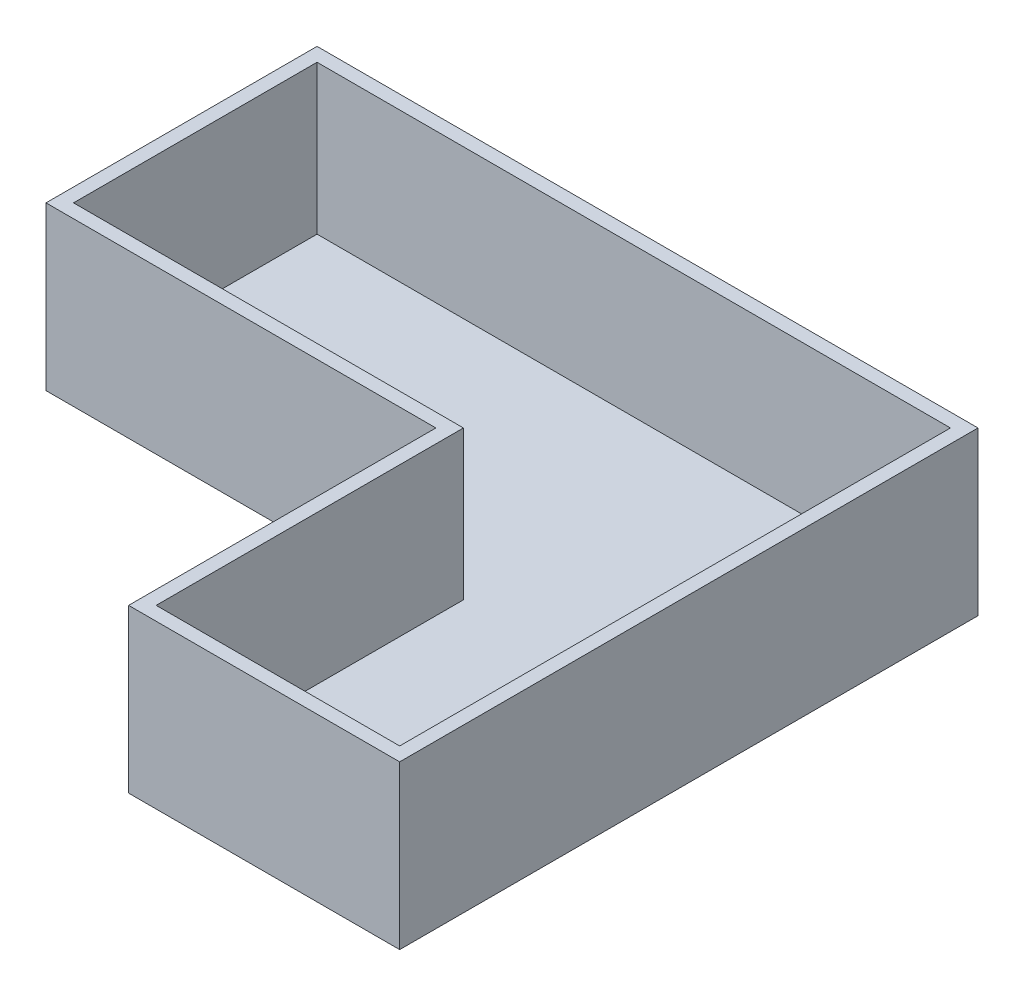
ISO-10303-21;
HEADER;
FILE_DESCRIPTION(('STEP AP214'),'2;1');
FILE_NAME('part.step','',(''),(''),'','','');
FILE_SCHEMA(('AUTOMOTIVE_DESIGN { 1 0 10303 214 1 1 1 1 }'));
ENDSEC;
DATA;
#1=APPLICATION_CONTEXT('core data for automotive mechanical design processes');
#2=APPLICATION_PROTOCOL_DEFINITION('international standard','automotive_design',2000,#1);
#3=PRODUCT_CONTEXT('',#1,'mechanical');
#4=PRODUCT('Part','Part','',(#3));
#5=PRODUCT_RELATED_PRODUCT_CATEGORY('part','',(#4));
#6=PRODUCT_DEFINITION_FORMATION('','',#4);
#7=PRODUCT_DEFINITION_CONTEXT('part definition',#1,'design');
#8=PRODUCT_DEFINITION('design','',#6,#7);
#9=PRODUCT_DEFINITION_SHAPE('','',#8);
#10=(LENGTH_UNIT() NAMED_UNIT(*) SI_UNIT(.MILLI.,.METRE.));
#11=(NAMED_UNIT(*) PLANE_ANGLE_UNIT() SI_UNIT($,.RADIAN.));
#12=(NAMED_UNIT(*) SI_UNIT($,.STERADIAN.) SOLID_ANGLE_UNIT());
#13=UNCERTAINTY_MEASURE_WITH_UNIT(LENGTH_MEASURE(1.E-05),#10,'distance_accuracy_value','');
#14=(GEOMETRIC_REPRESENTATION_CONTEXT(3) GLOBAL_UNCERTAINTY_ASSIGNED_CONTEXT((#13)) GLOBAL_UNIT_ASSIGNED_CONTEXT((#10,
#11,#12)) REPRESENTATION_CONTEXT('',''));
#15=CARTESIAN_POINT('',(0.,0.,0.));
#16=DIRECTION('',(0.,0.,1.));
#17=DIRECTION('',(1.,0.,0.));
#18=AXIS2_PLACEMENT_3D('',#15,#16,#17);
#19=CARTESIAN_POINT('',(859.6,300.,0.));
#20=DIRECTION('',(-1.,0.,0.));
#21=DIRECTION('',(0.,0.,1.));
#22=AXIS2_PLACEMENT_3D('',#19,#20,#21);
#23=PLANE('',#22);
#24=DIRECTION('',(0.,0.,-1.));
#25=VECTOR('',#24,1.);
#26=CARTESIAN_POINT('',(859.6,0.,0.));
#27=LINE('',#26,#25);
#28=CARTESIAN_POINT('',(859.6,0.,0.));
#29=VERTEX_POINT('',#28);
#30=CARTESIAN_POINT('',(859.6,0.,-1066.8));
#31=VERTEX_POINT('',#30);
#32=EDGE_CURVE('E129',#29,#31,#27,.T.);
#33=ORIENTED_EDGE('',*,*,#32,.T.);
#34=DIRECTION('',(0.,-1.,0.));
#35=VECTOR('',#34,1.);
#36=CARTESIAN_POINT('',(859.6,300.,-1066.8));
#37=LINE('',#36,#35);
#38=CARTESIAN_POINT('',(859.6,300.,-1066.8));
#39=VERTEX_POINT('',#38);
#40=EDGE_CURVE('E11',#39,#31,#37,.T.);
#41=ORIENTED_EDGE('',*,*,#40,.F.);
#42=DIRECTION('',(0.,0.,-1.));
#43=VECTOR('',#42,1.);
#44=CARTESIAN_POINT('',(859.6,300.,0.));
#45=LINE('',#44,#43);
#46=CARTESIAN_POINT('',(859.6,300.,0.));
#47=VERTEX_POINT('',#46);
#48=EDGE_CURVE('E141',#47,#39,#45,.T.);
#49=ORIENTED_EDGE('',*,*,#48,.F.);
#50=DIRECTION('',(0.,-1.,0.));
#51=VECTOR('',#50,1.);
#52=CARTESIAN_POINT('',(859.6,300.,0.));
#53=LINE('',#52,#51);
#54=EDGE_CURVE('E125',#47,#29,#53,.T.);
#55=ORIENTED_EDGE('',*,*,#54,.T.);
#56=EDGE_LOOP('',(#33,#41,#49,#55));
#57=FACE_BOUND('',#56,.T.);
#58=ADVANCED_FACE('F33',(#57),#23,.F.);
#59=CARTESIAN_POINT('',(359.6,300.,-1066.8));
#60=DIRECTION('',(0.,0.,1.));
#61=DIRECTION('',(1.,0.,0.));
#62=AXIS2_PLACEMENT_3D('',#59,#60,#61);
#63=PLANE('',#62);
#64=DIRECTION('',(-1.,0.,0.));
#65=VECTOR('',#64,1.);
#66=CARTESIAN_POINT('',(359.6,0.,-1066.8));
#67=LINE('',#66,#65);
#68=CARTESIAN_POINT('',(-359.6,0.,-1066.8));
#69=VERTEX_POINT('',#68);
#70=EDGE_CURVE('E132',#31,#69,#67,.T.);
#71=ORIENTED_EDGE('',*,*,#70,.T.);
#72=DIRECTION('',(0.,-1.,0.));
#73=VECTOR('',#72,1.);
#74=CARTESIAN_POINT('',(-359.6,300.,-1066.8));
#75=LINE('',#74,#73);
#76=CARTESIAN_POINT('',(-359.6,300.,-1066.8));
#77=VERTEX_POINT('',#76);
#78=EDGE_CURVE('E40',#77,#69,#75,.T.);
#79=ORIENTED_EDGE('',*,*,#78,.F.);
#80=DIRECTION('',(-1.,0.,0.));
#81=VECTOR('',#80,1.);
#82=CARTESIAN_POINT('',(359.6,300.,-1066.8));
#83=LINE('',#82,#81);
#84=EDGE_CURVE('E91',#39,#77,#83,.T.);
#85=ORIENTED_EDGE('',*,*,#84,.F.);
#86=ORIENTED_EDGE('',*,*,#40,.T.);
#87=EDGE_LOOP('',(#71,#79,#85,#86));
#88=FACE_BOUND('',#87,.T.);
#89=ADVANCED_FACE('F263',(#88),#63,.F.);
#90=CARTESIAN_POINT('',(-359.6,300.,-1066.8));
#91=DIRECTION('',(1.,0.,0.));
#92=DIRECTION('',(0.,0.,-1.));
#93=AXIS2_PLACEMENT_3D('',#90,#91,#92);
#94=PLANE('',#93);
#95=DIRECTION('',(0.,0.,1.));
#96=VECTOR('',#95,1.);
#97=CARTESIAN_POINT('',(-359.6,0.,-1066.8));
#98=LINE('',#97,#96);
#99=CARTESIAN_POINT('',(-359.6,0.,-566.8));
#100=VERTEX_POINT('',#99);
#101=EDGE_CURVE('E135',#69,#100,#98,.T.);
#102=ORIENTED_EDGE('',*,*,#101,.T.);
#103=DIRECTION('',(0.,-1.,0.));
#104=VECTOR('',#103,1.);
#105=CARTESIAN_POINT('',(-359.6,300.,-566.8));
#106=LINE('',#105,#104);
#107=CARTESIAN_POINT('',(-359.6,300.,-566.8));
#108=VERTEX_POINT('',#107);
#109=EDGE_CURVE('E120',#108,#100,#106,.T.);
#110=ORIENTED_EDGE('',*,*,#109,.F.);
#111=DIRECTION('',(0.,0.,1.));
#112=VECTOR('',#111,1.);
#113=CARTESIAN_POINT('',(-359.6,300.,-1066.8));
#114=LINE('',#113,#112);
#115=EDGE_CURVE('E108',#77,#108,#114,.T.);
#116=ORIENTED_EDGE('',*,*,#115,.F.);
#117=ORIENTED_EDGE('',*,*,#78,.T.);
#118=EDGE_LOOP('',(#102,#110,#116,#117));
#119=FACE_BOUND('',#118,.T.);
#120=ADVANCED_FACE('F147',(#119),#94,.F.);
#121=CARTESIAN_POINT('',(-359.6,300.,-566.8));
#122=DIRECTION('',(0.,0.,-1.));
#123=DIRECTION('',(-1.,0.,0.));
#124=AXIS2_PLACEMENT_3D('',#121,#122,#123);
#125=PLANE('',#124);
#126=DIRECTION('',(1.,0.,0.));
#127=VECTOR('',#126,1.);
#128=CARTESIAN_POINT('',(-359.6,0.,-566.8));
#129=LINE('',#128,#127);
#130=CARTESIAN_POINT('',(359.6,0.,-566.8));
#131=VERTEX_POINT('',#130);
#132=EDGE_CURVE('E117',#100,#131,#129,.T.);
#133=ORIENTED_EDGE('',*,*,#132,.T.);
#134=DIRECTION('',(0.,-1.,0.));
#135=VECTOR('',#134,1.);
#136=CARTESIAN_POINT('',(359.6,300.,-566.8));
#137=LINE('',#136,#135);
#138=CARTESIAN_POINT('',(359.6,300.,-566.8));
#139=VERTEX_POINT('',#138);
#140=EDGE_CURVE('E114',#139,#131,#137,.T.);
#141=ORIENTED_EDGE('',*,*,#140,.F.);
#142=DIRECTION('',(1.,0.,0.));
#143=VECTOR('',#142,1.);
#144=CARTESIAN_POINT('',(-359.6,300.,-566.8));
#145=LINE('',#144,#143);
#146=EDGE_CURVE('E101',#108,#139,#145,.T.);
#147=ORIENTED_EDGE('',*,*,#146,.F.);
#148=ORIENTED_EDGE('',*,*,#109,.T.);
#149=EDGE_LOOP('',(#133,#141,#147,#148));
#150=FACE_BOUND('',#149,.T.);
#151=ADVANCED_FACE('F115',(#150),#125,.F.);
#152=CARTESIAN_POINT('',(359.6,300.,-1.32114896692016E-13));
#153=DIRECTION('',(1.,0.,0.));
#154=DIRECTION('',(0.,0.,-1.));
#155=AXIS2_PLACEMENT_3D('',#152,#153,#154);
#156=PLANE('',#155);
#157=DIRECTION('',(0.,0.,1.));
#158=VECTOR('',#157,1.);
#159=CARTESIAN_POINT('',(359.6,0.,-1.32114896692016E-13));
#160=LINE('',#159,#158);
#161=CARTESIAN_POINT('',(359.6,0.,-1.32114896692016E-13));
#162=VERTEX_POINT('',#161);
#163=EDGE_CURVE('E138',#131,#162,#160,.T.);
#164=ORIENTED_EDGE('',*,*,#163,.T.);
#165=DIRECTION('',(0.,-1.,0.));
#166=VECTOR('',#165,1.);
#167=CARTESIAN_POINT('',(359.6,300.,-1.32114896692016E-13));
#168=LINE('',#167,#166);
#169=CARTESIAN_POINT('',(359.6,300.,-1.32114896692016E-13));
#170=VERTEX_POINT('',#169);
#171=EDGE_CURVE('E121',#170,#162,#168,.T.);
#172=ORIENTED_EDGE('',*,*,#171,.F.);
#173=DIRECTION('',(0.,0.,1.));
#174=VECTOR('',#173,1.);
#175=CARTESIAN_POINT('',(359.6,300.,-1.32114896692016E-13));
#176=LINE('',#175,#174);
#177=EDGE_CURVE('E105',#139,#170,#176,.T.);
#178=ORIENTED_EDGE('',*,*,#177,.F.);
#179=ORIENTED_EDGE('',*,*,#140,.T.);
#180=EDGE_LOOP('',(#164,#172,#178,#179));
#181=FACE_BOUND('',#180,.T.);
#182=ADVANCED_FACE('F123',(#181),#156,.F.);
#183=CARTESIAN_POINT('',(359.6,300.,-1.32114896692016E-13));
#184=DIRECTION('',(0.,0.,-1.));
#185=DIRECTION('',(-1.,0.,0.));
#186=AXIS2_PLACEMENT_3D('',#183,#184,#185);
#187=PLANE('',#186);
#188=DIRECTION('',(1.,0.,0.));
#189=VECTOR('',#188,1.);
#190=CARTESIAN_POINT('',(359.6,0.,-1.32114896692016E-13));
#191=LINE('',#190,#189);
#192=EDGE_CURVE('E83',#162,#29,#191,.T.);
#193=ORIENTED_EDGE('',*,*,#192,.T.);
#194=ORIENTED_EDGE('',*,*,#54,.F.);
#195=DIRECTION('',(1.,0.,0.));
#196=VECTOR('',#195,1.);
#197=CARTESIAN_POINT('',(359.6,300.,-1.32114896692016E-13));
#198=LINE('',#197,#196);
#199=EDGE_CURVE('E56',#170,#47,#198,.T.);
#200=ORIENTED_EDGE('',*,*,#199,.F.);
#201=ORIENTED_EDGE('',*,*,#171,.T.);
#202=EDGE_LOOP('',(#193,#194,#200,#201));
#203=FACE_BOUND('',#202,.T.);
#204=ADVANCED_FACE('F151',(#203),#187,.F.);
#205=CARTESIAN_POINT('',(0.,300.,0.));
#206=DIRECTION('',(0.,-1.,0.));
#207=DIRECTION('',(0.,0.,-1.));
#208=AXIS2_PLACEMENT_3D('',#205,#206,#207);
#209=PLANE('',#208);
#210=DIRECTION('',(0.,0.,-1.));
#211=VECTOR('',#210,1.);
#212=CARTESIAN_POINT('',(834.2,300.,-25.4));
#213=LINE('',#212,#211);
#214=CARTESIAN_POINT('',(834.2,300.,-25.4));
#215=VERTEX_POINT('',#214);
#216=CARTESIAN_POINT('',(834.2,300.,-1041.4));
#217=VERTEX_POINT('',#216);
#218=EDGE_CURVE('E187',#215,#217,#213,.T.);
#219=ORIENTED_EDGE('',*,*,#218,.F.);
#220=DIRECTION('',(1.,0.,0.));
#221=VECTOR('',#220,1.);
#222=CARTESIAN_POINT('',(385.,300.,-25.4000000000001));
#223=LINE('',#222,#221);
#224=CARTESIAN_POINT('',(385.,300.,-25.4000000000001));
#225=VERTEX_POINT('',#224);
#226=EDGE_CURVE('E47',#225,#215,#223,.T.);
#227=ORIENTED_EDGE('',*,*,#226,.F.);
#228=DIRECTION('',(0.,0.,1.));
#229=VECTOR('',#228,1.);
#230=CARTESIAN_POINT('',(385.,300.,-592.2));
#231=LINE('',#230,#229);
#232=CARTESIAN_POINT('',(385.,300.,-592.2));
#233=VERTEX_POINT('',#232);
#234=EDGE_CURVE('E174',#233,#225,#231,.T.);
#235=ORIENTED_EDGE('',*,*,#234,.F.);
#236=DIRECTION('',(1.,0.,0.));
#237=VECTOR('',#236,1.);
#238=CARTESIAN_POINT('',(-334.2,300.,-592.2));
#239=LINE('',#238,#237);
#240=CARTESIAN_POINT('',(-334.2,300.,-592.2));
#241=VERTEX_POINT('',#240);
#242=EDGE_CURVE('E178',#241,#233,#239,.T.);
#243=ORIENTED_EDGE('',*,*,#242,.F.);
#244=DIRECTION('',(0.,0.,1.));
#245=VECTOR('',#244,1.);
#246=CARTESIAN_POINT('',(-334.2,300.,-1041.4));
#247=LINE('',#246,#245);
#248=CARTESIAN_POINT('',(-334.2,300.,-1041.4));
#249=VERTEX_POINT('',#248);
#250=EDGE_CURVE('E181',#249,#241,#247,.T.);
#251=ORIENTED_EDGE('',*,*,#250,.F.);
#252=DIRECTION('',(-1.,0.,0.));
#253=VECTOR('',#252,1.);
#254=CARTESIAN_POINT('',(834.2,300.,-1041.4));
#255=LINE('',#254,#253);
#256=EDGE_CURVE('E184',#217,#249,#255,.T.);
#257=ORIENTED_EDGE('',*,*,#256,.F.);
#258=EDGE_LOOP('',(#219,#227,#235,#243,#251,#257));
#259=FACE_BOUND('',#258,.T.);
#260=ORIENTED_EDGE('',*,*,#48,.T.);
#261=ORIENTED_EDGE('',*,*,#84,.T.);
#262=ORIENTED_EDGE('',*,*,#115,.T.);
#263=ORIENTED_EDGE('',*,*,#146,.T.);
#264=ORIENTED_EDGE('',*,*,#177,.T.);
#265=ORIENTED_EDGE('',*,*,#199,.T.);
#266=EDGE_LOOP('',(#260,#261,#262,#263,#264,#265));
#267=FACE_BOUND('',#266,.T.);
#268=ADVANCED_FACE('F103',(#259,#267),#209,.F.);
#269=CARTESIAN_POINT('',(0.,0.,0.));
#270=DIRECTION('',(0.,-1.,0.));
#271=DIRECTION('',(0.,0.,-1.));
#272=AXIS2_PLACEMENT_3D('',#269,#270,#271);
#273=PLANE('',#272);
#274=ORIENTED_EDGE('',*,*,#32,.F.);
#275=ORIENTED_EDGE('',*,*,#192,.F.);
#276=ORIENTED_EDGE('',*,*,#163,.F.);
#277=ORIENTED_EDGE('',*,*,#132,.F.);
#278=ORIENTED_EDGE('',*,*,#101,.F.);
#279=ORIENTED_EDGE('',*,*,#70,.F.);
#280=EDGE_LOOP('',(#274,#275,#276,#277,#278,#279));
#281=FACE_BOUND('',#280,.T.);
#282=ADVANCED_FACE('F150',(#281),#273,.T.);
#283=CARTESIAN_POINT('',(385.,25.4,-25.4000000000001));
#284=DIRECTION('',(0.,0.,1.));
#285=DIRECTION('',(1.,0.,0.));
#286=AXIS2_PLACEMENT_3D('',#283,#284,#285);
#287=PLANE('',#286);
#288=ORIENTED_EDGE('',*,*,#226,.T.);
#289=DIRECTION('',(0.,1.,0.));
#290=VECTOR('',#289,1.);
#291=CARTESIAN_POINT('',(834.2,25.4,-25.4));
#292=LINE('',#291,#290);
#293=CARTESIAN_POINT('',(834.2,25.4,-25.4));
#294=VERTEX_POINT('',#293);
#295=EDGE_CURVE('E158',#294,#215,#292,.T.);
#296=ORIENTED_EDGE('',*,*,#295,.F.);
#297=DIRECTION('',(1.,0.,0.));
#298=VECTOR('',#297,1.);
#299=CARTESIAN_POINT('',(385.,25.4,-25.4000000000001));
#300=LINE('',#299,#298);
#301=CARTESIAN_POINT('',(385.,25.4,-25.4000000000001));
#302=VERTEX_POINT('',#301);
#303=EDGE_CURVE('E177',#302,#294,#300,.T.);
#304=ORIENTED_EDGE('',*,*,#303,.F.);
#305=DIRECTION('',(0.,1.,0.));
#306=VECTOR('',#305,1.);
#307=CARTESIAN_POINT('',(385.,25.4,-25.4000000000001));
#308=LINE('',#307,#306);
#309=EDGE_CURVE('E133',#302,#225,#308,.T.);
#310=ORIENTED_EDGE('',*,*,#309,.T.);
#311=EDGE_LOOP('',(#288,#296,#304,#310));
#312=FACE_BOUND('',#311,.T.);
#313=ADVANCED_FACE('F214',(#312),#287,.F.);
#314=CARTESIAN_POINT('',(385.,25.4,-592.2));
#315=DIRECTION('',(-1.,0.,0.));
#316=DIRECTION('',(0.,0.,1.));
#317=AXIS2_PLACEMENT_3D('',#314,#315,#316);
#318=PLANE('',#317);
#319=ORIENTED_EDGE('',*,*,#234,.T.);
#320=ORIENTED_EDGE('',*,*,#309,.F.);
#321=DIRECTION('',(0.,0.,1.));
#322=VECTOR('',#321,1.);
#323=CARTESIAN_POINT('',(385.,25.4,-592.2));
#324=LINE('',#323,#322);
#325=CARTESIAN_POINT('',(385.,25.4,-592.2));
#326=VERTEX_POINT('',#325);
#327=EDGE_CURVE('E161',#326,#302,#324,.T.);
#328=ORIENTED_EDGE('',*,*,#327,.F.);
#329=DIRECTION('',(0.,1.,0.));
#330=VECTOR('',#329,1.);
#331=CARTESIAN_POINT('',(385.,25.4,-592.2));
#332=LINE('',#331,#330);
#333=EDGE_CURVE('E170',#326,#233,#332,.T.);
#334=ORIENTED_EDGE('',*,*,#333,.T.);
#335=EDGE_LOOP('',(#319,#320,#328,#334));
#336=FACE_BOUND('',#335,.T.);
#337=ADVANCED_FACE('F230',(#336),#318,.F.);
#338=CARTESIAN_POINT('',(-334.2,25.4,-592.2));
#339=DIRECTION('',(0.,0.,1.));
#340=DIRECTION('',(1.,0.,0.));
#341=AXIS2_PLACEMENT_3D('',#338,#339,#340);
#342=PLANE('',#341);
#343=ORIENTED_EDGE('',*,*,#242,.T.);
#344=ORIENTED_EDGE('',*,*,#333,.F.);
#345=DIRECTION('',(1.,0.,0.));
#346=VECTOR('',#345,1.);
#347=CARTESIAN_POINT('',(-334.2,25.4,-592.2));
#348=LINE('',#347,#346);
#349=CARTESIAN_POINT('',(-334.2,25.4,-592.2));
#350=VERTEX_POINT('',#349);
#351=EDGE_CURVE('E193',#350,#326,#348,.T.);
#352=ORIENTED_EDGE('',*,*,#351,.F.);
#353=DIRECTION('',(0.,1.,0.));
#354=VECTOR('',#353,1.);
#355=CARTESIAN_POINT('',(-334.2,25.4,-592.2));
#356=LINE('',#355,#354);
#357=EDGE_CURVE('E167',#350,#241,#356,.T.);
#358=ORIENTED_EDGE('',*,*,#357,.T.);
#359=EDGE_LOOP('',(#343,#344,#352,#358));
#360=FACE_BOUND('',#359,.T.);
#361=ADVANCED_FACE('F235',(#360),#342,.F.);
#362=CARTESIAN_POINT('',(-334.2,25.4,-1041.4));
#363=DIRECTION('',(-1.,0.,0.));
#364=DIRECTION('',(0.,0.,1.));
#365=AXIS2_PLACEMENT_3D('',#362,#363,#364);
#366=PLANE('',#365);
#367=ORIENTED_EDGE('',*,*,#250,.T.);
#368=ORIENTED_EDGE('',*,*,#357,.F.);
#369=DIRECTION('',(0.,0.,1.));
#370=VECTOR('',#369,1.);
#371=CARTESIAN_POINT('',(-334.2,25.4,-1041.4));
#372=LINE('',#371,#370);
#373=CARTESIAN_POINT('',(-334.2,25.4,-1041.4));
#374=VERTEX_POINT('',#373);
#375=EDGE_CURVE('E196',#374,#350,#372,.T.);
#376=ORIENTED_EDGE('',*,*,#375,.F.);
#377=DIRECTION('',(0.,1.,0.));
#378=VECTOR('',#377,1.);
#379=CARTESIAN_POINT('',(-334.2,25.4,-1041.4));
#380=LINE('',#379,#378);
#381=EDGE_CURVE('E164',#374,#249,#380,.T.);
#382=ORIENTED_EDGE('',*,*,#381,.T.);
#383=EDGE_LOOP('',(#367,#368,#376,#382));
#384=FACE_BOUND('',#383,.T.);
#385=ADVANCED_FACE('F253',(#384),#366,.F.);
#386=CARTESIAN_POINT('',(834.2,25.4,-1041.4));
#387=DIRECTION('',(0.,0.,-1.));
#388=DIRECTION('',(-1.,0.,0.));
#389=AXIS2_PLACEMENT_3D('',#386,#387,#388);
#390=PLANE('',#389);
#391=ORIENTED_EDGE('',*,*,#256,.T.);
#392=ORIENTED_EDGE('',*,*,#381,.F.);
#393=DIRECTION('',(-1.,0.,0.));
#394=VECTOR('',#393,1.);
#395=CARTESIAN_POINT('',(834.2,25.4,-1041.4));
#396=LINE('',#395,#394);
#397=CARTESIAN_POINT('',(834.2,25.4,-1041.4));
#398=VERTEX_POINT('',#397);
#399=EDGE_CURVE('E199',#398,#374,#396,.T.);
#400=ORIENTED_EDGE('',*,*,#399,.F.);
#401=DIRECTION('',(0.,1.,0.));
#402=VECTOR('',#401,1.);
#403=CARTESIAN_POINT('',(834.2,25.4,-1041.4));
#404=LINE('',#403,#402);
#405=EDGE_CURVE('E160',#398,#217,#404,.T.);
#406=ORIENTED_EDGE('',*,*,#405,.T.);
#407=EDGE_LOOP('',(#391,#392,#400,#406));
#408=FACE_BOUND('',#407,.T.);
#409=ADVANCED_FACE('F249',(#408),#390,.F.);
#410=CARTESIAN_POINT('',(834.2,25.4,-25.4));
#411=DIRECTION('',(1.,0.,0.));
#412=DIRECTION('',(0.,0.,-1.));
#413=AXIS2_PLACEMENT_3D('',#410,#411,#412);
#414=PLANE('',#413);
#415=ORIENTED_EDGE('',*,*,#218,.T.);
#416=ORIENTED_EDGE('',*,*,#405,.F.);
#417=DIRECTION('',(0.,0.,-1.));
#418=VECTOR('',#417,1.);
#419=CARTESIAN_POINT('',(834.2,25.4,-25.4));
#420=LINE('',#419,#418);
#421=EDGE_CURVE('E202',#294,#398,#420,.T.);
#422=ORIENTED_EDGE('',*,*,#421,.F.);
#423=ORIENTED_EDGE('',*,*,#295,.T.);
#424=EDGE_LOOP('',(#415,#416,#422,#423));
#425=FACE_BOUND('',#424,.T.);
#426=ADVANCED_FACE('F243',(#425),#414,.F.);
#427=CARTESIAN_POINT('',(0.,25.4,0.));
#428=DIRECTION('',(0.,1.,0.));
#429=DIRECTION('',(0.,0.,1.));
#430=AXIS2_PLACEMENT_3D('',#427,#428,#429);
#431=PLANE('',#430);
#432=ORIENTED_EDGE('',*,*,#303,.T.);
#433=ORIENTED_EDGE('',*,*,#421,.T.);
#434=ORIENTED_EDGE('',*,*,#399,.T.);
#435=ORIENTED_EDGE('',*,*,#375,.T.);
#436=ORIENTED_EDGE('',*,*,#351,.T.);
#437=ORIENTED_EDGE('',*,*,#327,.T.);
#438=EDGE_LOOP('',(#432,#433,#434,#435,#436,#437));
#439=FACE_BOUND('',#438,.T.);
#440=ADVANCED_FACE('F209',(#439),#431,.T.);
#441=CLOSED_SHELL('',(#58,#89,#120,#151,#182,#204,#268,#282,#313,#337,#361,#385,#409,#426,#440));
#442=MANIFOLD_SOLID_BREP('B2',#441);
#443=ADVANCED_BREP_SHAPE_REPRESENTATION('',(#18,#442),#14);
#444=SHAPE_DEFINITION_REPRESENTATION(#9,#443);
ENDSEC;
END-ISO-10303-21;
